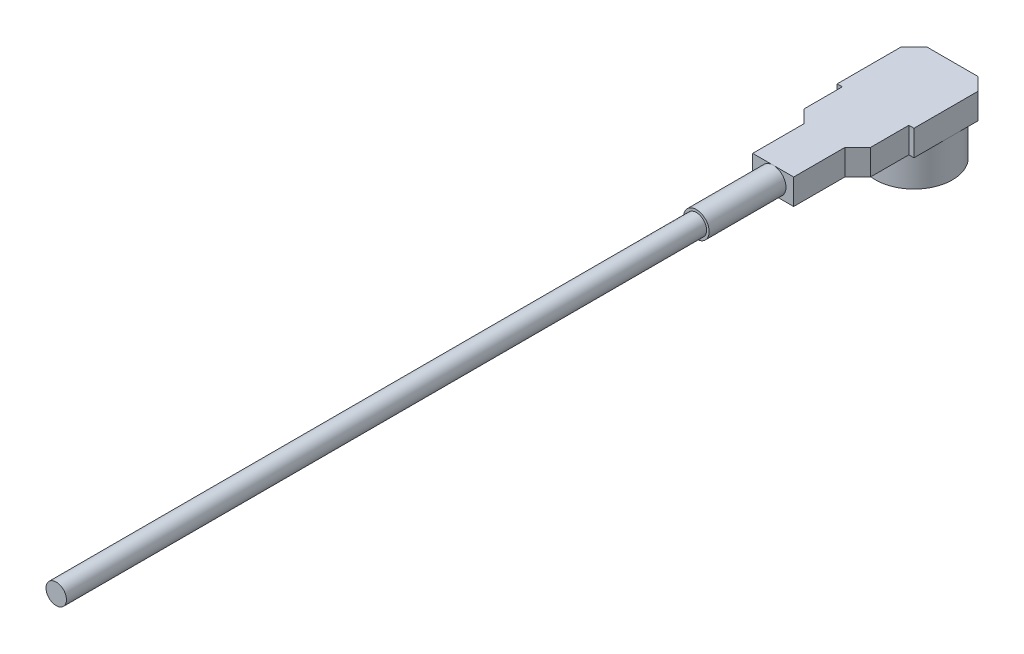
ISO-10303-21;
HEADER;
FILE_DESCRIPTION(('STEP AP214'),'2;1');
FILE_NAME('part.step','',(''),(''),'','','');
FILE_SCHEMA(('AUTOMOTIVE_DESIGN { 1 0 10303 214 1 1 1 1 }'));
ENDSEC;
DATA;
#1=APPLICATION_CONTEXT('core data for automotive mechanical design processes');
#2=APPLICATION_PROTOCOL_DEFINITION('international standard','automotive_design',2000,#1);
#3=PRODUCT_CONTEXT('',#1,'mechanical');
#4=PRODUCT('Part','Part','',(#3));
#5=PRODUCT_RELATED_PRODUCT_CATEGORY('part','',(#4));
#6=PRODUCT_DEFINITION_FORMATION('','',#4);
#7=PRODUCT_DEFINITION_CONTEXT('part definition',#1,'design');
#8=PRODUCT_DEFINITION('design','',#6,#7);
#9=PRODUCT_DEFINITION_SHAPE('','',#8);
#10=(LENGTH_UNIT() NAMED_UNIT(*) SI_UNIT(.MILLI.,.METRE.));
#11=(NAMED_UNIT(*) PLANE_ANGLE_UNIT() SI_UNIT($,.RADIAN.));
#12=(NAMED_UNIT(*) SI_UNIT($,.STERADIAN.) SOLID_ANGLE_UNIT());
#13=UNCERTAINTY_MEASURE_WITH_UNIT(LENGTH_MEASURE(1.E-05),#10,'distance_accuracy_value','');
#14=(GEOMETRIC_REPRESENTATION_CONTEXT(3) GLOBAL_UNCERTAINTY_ASSIGNED_CONTEXT((#13)) GLOBAL_UNIT_ASSIGNED_CONTEXT((#10,
#11,#12)) REPRESENTATION_CONTEXT('',''));
#15=CARTESIAN_POINT('',(0.,0.,0.));
#16=DIRECTION('',(0.,0.,1.));
#17=DIRECTION('',(1.,0.,0.));
#18=AXIS2_PLACEMENT_3D('',#15,#16,#17);
#19=CARTESIAN_POINT('',(0.,1.5,5.5));
#20=DIRECTION('',(0.,0.,1.));
#21=DIRECTION('',(1.,0.,0.));
#22=AXIS2_PLACEMENT_3D('',#19,#20,#21);
#23=PLANE('',#22);
#24=CARTESIAN_POINT('',(0.,2.,5.5));
#25=DIRECTION('',(0.,0.,1.));
#26=DIRECTION('',(1.,0.,0.));
#27=AXIS2_PLACEMENT_3D('',#24,#25,#26);
#28=CIRCLE('',#27,0.5);
#29=CARTESIAN_POINT('',(0.,2.5,5.5));
#30=VERTEX_POINT('',#29);
#31=CARTESIAN_POINT('',(0.,1.5,5.5));
#32=VERTEX_POINT('',#31);
#33=EDGE_CURVE('E181',#30,#32,#28,.T.);
#34=ORIENTED_EDGE('',*,*,#33,.F.);
#35=DIRECTION('',(1.,0.,0.));
#36=VECTOR('',#35,1.);
#37=CARTESIAN_POINT('',(0.,2.5,5.5));
#38=LINE('',#37,#36);
#39=CARTESIAN_POINT('',(-0.8,2.5,5.5));
#40=VERTEX_POINT('',#39);
#41=EDGE_CURVE('E160',#40,#30,#38,.T.);
#42=ORIENTED_EDGE('',*,*,#41,.F.);
#43=DIRECTION('',(0.,1.,0.));
#44=VECTOR('',#43,1.);
#45=CARTESIAN_POINT('',(-0.8,1.5,5.5));
#46=LINE('',#45,#44);
#47=CARTESIAN_POINT('',(-0.8,1.5,5.5));
#48=VERTEX_POINT('',#47);
#49=EDGE_CURVE('E339',#48,#40,#46,.T.);
#50=ORIENTED_EDGE('',*,*,#49,.F.);
#51=DIRECTION('',(1.,0.,0.));
#52=VECTOR('',#51,1.);
#53=CARTESIAN_POINT('',(0.,1.5,5.5));
#54=LINE('',#53,#52);
#55=EDGE_CURVE('E183',#48,#32,#54,.T.);
#56=ORIENTED_EDGE('',*,*,#55,.T.);
#57=EDGE_LOOP('',(#34,#42,#50,#56));
#58=FACE_BOUND('',#57,.T.);
#59=ADVANCED_FACE('F41',(#58),#23,.T.);
#60=CARTESIAN_POINT('',(0.,2.5,0.));
#61=DIRECTION('',(0.,-1.,0.));
#62=DIRECTION('',(0.,0.,-1.));
#63=AXIS2_PLACEMENT_3D('',#60,#61,#62);
#64=CYLINDRICAL_SURFACE('',#63,1.5);
#65=CARTESIAN_POINT('',(0.,0.,0.));
#66=DIRECTION('',(0.,1.,0.));
#67=DIRECTION('',(0.,0.,1.));
#68=AXIS2_PLACEMENT_3D('',#65,#66,#67);
#69=CIRCLE('',#68,1.5);
#70=CARTESIAN_POINT('',(0.,0.,1.5));
#71=VERTEX_POINT('',#70);
#72=EDGE_CURVE('E45',#71,#71,#69,.T.);
#73=ORIENTED_EDGE('',*,*,#72,.T.);
#74=EDGE_LOOP('',(#73));
#75=FACE_BOUND('',#74,.T.);
#76=CARTESIAN_POINT('',(0.,1.5,0.));
#77=DIRECTION('',(0.,1.,0.));
#78=DIRECTION('',(0.,0.,1.));
#79=AXIS2_PLACEMENT_3D('',#76,#77,#78);
#80=CIRCLE('',#79,1.5);
#81=CARTESIAN_POINT('',(1.5,1.5,0.));
#82=VERTEX_POINT('',#81);
#83=CARTESIAN_POINT('',(0.,1.5,-1.5));
#84=VERTEX_POINT('',#83);
#85=EDGE_CURVE('E346',#82,#84,#80,.T.);
#86=ORIENTED_EDGE('',*,*,#85,.F.);
#87=CARTESIAN_POINT('',(-1.5,1.5,0.));
#88=VERTEX_POINT('',#87);
#89=EDGE_CURVE('E301',#88,#82,#80,.T.);
#90=ORIENTED_EDGE('',*,*,#89,.F.);
#91=EDGE_CURVE('E66',#84,#88,#80,.T.);
#92=ORIENTED_EDGE('',*,*,#91,.F.);
#93=EDGE_LOOP('',(#86,#90,#92));
#94=FACE_BOUND('',#93,.T.);
#95=ADVANCED_FACE('F43',(#75,#94),#64,.T.);
#96=CARTESIAN_POINT('',(0.,2.5,0.));
#97=DIRECTION('',(0.,1.,0.));
#98=DIRECTION('',(0.,0.,1.));
#99=AXIS2_PLACEMENT_3D('',#96,#97,#98);
#100=PLANE('',#99);
#101=DIRECTION('',(-1.,0.,0.));
#102=VECTOR('',#101,1.);
#103=CARTESIAN_POINT('',(0.,2.5,1.5));
#104=LINE('',#103,#102);
#105=CARTESIAN_POINT('',(1.5,2.5,1.5));
#106=VERTEX_POINT('',#105);
#107=CARTESIAN_POINT('',(1.3,2.5,1.5));
#108=VERTEX_POINT('',#107);
#109=EDGE_CURVE('E271',#106,#108,#104,.T.);
#110=ORIENTED_EDGE('',*,*,#109,.F.);
#111=DIRECTION('',(0.,0.,-1.));
#112=VECTOR('',#111,1.);
#113=CARTESIAN_POINT('',(1.5,2.5,0.));
#114=LINE('',#113,#112);
#115=CARTESIAN_POINT('',(1.5,2.5,-1.00000000000001));
#116=VERTEX_POINT('',#115);
#117=EDGE_CURVE('E275',#106,#116,#114,.T.);
#118=ORIENTED_EDGE('',*,*,#117,.T.);
#119=DIRECTION('',(0.707106781186556,0.,0.707106781186539));
#120=VECTOR('',#119,1.);
#121=CARTESIAN_POINT('',(1.24999999999999,2.5,-1.25000000000002));
#122=LINE('',#121,#120);
#123=CARTESIAN_POINT('',(1.,2.5,-1.5));
#124=VERTEX_POINT('',#123);
#125=EDGE_CURVE('E278',#124,#116,#122,.T.);
#126=ORIENTED_EDGE('',*,*,#125,.F.);
#127=DIRECTION('',(-1.,0.,0.));
#128=VECTOR('',#127,1.);
#129=CARTESIAN_POINT('',(0.,2.5,-1.5));
#130=LINE('',#129,#128);
#131=CARTESIAN_POINT('',(-1.,2.5,-1.5));
#132=VERTEX_POINT('',#131);
#133=EDGE_CURVE('E282',#124,#132,#130,.T.);
#134=ORIENTED_EDGE('',*,*,#133,.T.);
#135=DIRECTION('',(-0.707106781186542,0.,0.707106781186554));
#136=VECTOR('',#135,1.);
#137=CARTESIAN_POINT('',(-1.25000000000001,2.5,-1.24999999999999));
#138=LINE('',#137,#136);
#139=CARTESIAN_POINT('',(-1.5,2.5,-0.999999999999991));
#140=VERTEX_POINT('',#139);
#141=EDGE_CURVE('E285',#132,#140,#138,.T.);
#142=ORIENTED_EDGE('',*,*,#141,.T.);
#143=DIRECTION('',(0.,0.,-1.));
#144=VECTOR('',#143,1.);
#145=CARTESIAN_POINT('',(-1.5,2.5,0.));
#146=LINE('',#145,#144);
#147=CARTESIAN_POINT('',(-1.5,2.5,1.5));
#148=VERTEX_POINT('',#147);
#149=EDGE_CURVE('E289',#148,#140,#146,.T.);
#150=ORIENTED_EDGE('',*,*,#149,.F.);
#151=DIRECTION('',(-1.,0.,0.));
#152=VECTOR('',#151,1.);
#153=CARTESIAN_POINT('',(0.,2.5,1.5));
#154=LINE('',#153,#152);
#155=CARTESIAN_POINT('',(-1.3,2.5,1.5));
#156=VERTEX_POINT('',#155);
#157=EDGE_CURVE('E292',#156,#148,#154,.T.);
#158=ORIENTED_EDGE('',*,*,#157,.F.);
#159=DIRECTION('',(0.,0.,1.));
#160=VECTOR('',#159,1.);
#161=CARTESIAN_POINT('',(-1.3,2.5,0.));
#162=LINE('',#161,#160);
#163=CARTESIAN_POINT('',(-1.3,2.5,3.));
#164=VERTEX_POINT('',#163);
#165=EDGE_CURVE('E202',#156,#164,#162,.T.);
#166=ORIENTED_EDGE('',*,*,#165,.T.);
#167=DIRECTION('',(-0.707106781186548,0.,-0.707106781186547));
#168=VECTOR('',#167,1.);
#169=CARTESIAN_POINT('',(-2.15,2.5,2.15));
#170=LINE('',#169,#168);
#171=CARTESIAN_POINT('',(-0.8,2.5,3.5));
#172=VERTEX_POINT('',#171);
#173=EDGE_CURVE('E255',#172,#164,#170,.T.);
#174=ORIENTED_EDGE('',*,*,#173,.F.);
#175=DIRECTION('',(0.,0.,1.));
#176=VECTOR('',#175,1.);
#177=CARTESIAN_POINT('',(-0.8,2.5,0.));
#178=LINE('',#177,#176);
#179=EDGE_CURVE('E168',#172,#40,#178,.T.);
#180=ORIENTED_EDGE('',*,*,#179,.T.);
#181=ORIENTED_EDGE('',*,*,#41,.T.);
#182=CARTESIAN_POINT('',(0.799999999999999,2.5,5.5));
#183=VERTEX_POINT('',#182);
#184=EDGE_CURVE('E164',#30,#183,#38,.T.);
#185=ORIENTED_EDGE('',*,*,#184,.T.);
#186=DIRECTION('',(0.,0.,-1.));
#187=VECTOR('',#186,1.);
#188=CARTESIAN_POINT('',(0.799999999999999,2.5,0.));
#189=LINE('',#188,#187);
#190=CARTESIAN_POINT('',(0.799999999999999,2.5,3.5));
#191=VERTEX_POINT('',#190);
#192=EDGE_CURVE('E172',#183,#191,#189,.T.);
#193=ORIENTED_EDGE('',*,*,#192,.T.);
#194=DIRECTION('',(0.707106781186548,0.,-0.707106781186547));
#195=VECTOR('',#194,1.);
#196=CARTESIAN_POINT('',(2.15,2.5,2.15));
#197=LINE('',#196,#195);
#198=CARTESIAN_POINT('',(1.3,2.5,3.));
#199=VERTEX_POINT('',#198);
#200=EDGE_CURVE('E263',#191,#199,#197,.T.);
#201=ORIENTED_EDGE('',*,*,#200,.T.);
#202=DIRECTION('',(0.,0.,-1.));
#203=VECTOR('',#202,1.);
#204=CARTESIAN_POINT('',(1.3,2.5,0.));
#205=LINE('',#204,#203);
#206=EDGE_CURVE('E267',#199,#108,#205,.T.);
#207=ORIENTED_EDGE('',*,*,#206,.T.);
#208=EDGE_LOOP('',(#110,#118,#126,#134,#142,#150,#158,#166,#174,#180,#181,#185,#193,#201,#207));
#209=FACE_BOUND('',#208,.T.);
#210=ADVANCED_FACE('F162',(#209),#100,.T.);
#211=CARTESIAN_POINT('',(0.,0.,0.));
#212=DIRECTION('',(0.,1.,0.));
#213=DIRECTION('',(0.,0.,1.));
#214=AXIS2_PLACEMENT_3D('',#211,#212,#213);
#215=PLANE('',#214);
#216=ORIENTED_EDGE('',*,*,#72,.F.);
#217=EDGE_LOOP('',(#216));
#218=FACE_BOUND('',#217,.T.);
#219=CARTESIAN_POINT('',(0.,0.,0.));
#220=DIRECTION('',(0.,1.,0.));
#221=DIRECTION('',(0.,0.,1.));
#222=AXIS2_PLACEMENT_3D('',#219,#220,#221);
#223=CIRCLE('',#222,1.);
#224=CARTESIAN_POINT('',(0.,0.,1.));
#225=VERTEX_POINT('',#224);
#226=EDGE_CURVE('E193',#225,#225,#223,.T.);
#227=ORIENTED_EDGE('',*,*,#226,.T.);
#228=EDGE_LOOP('',(#227));
#229=FACE_BOUND('',#228,.T.);
#230=ADVANCED_FACE('F506',(#218,#229),#215,.F.);
#231=CARTESIAN_POINT('',(0.,2.5,0.));
#232=DIRECTION('',(0.,-1.,0.));
#233=DIRECTION('',(0.,0.,-1.));
#234=AXIS2_PLACEMENT_3D('',#231,#232,#233);
#235=CYLINDRICAL_SURFACE('',#234,1.);
#236=CARTESIAN_POINT('',(0.,1.5,0.));
#237=DIRECTION('',(0.,-1.,0.));
#238=DIRECTION('',(0.,0.,-1.));
#239=AXIS2_PLACEMENT_3D('',#236,#237,#238);
#240=CIRCLE('',#239,1.);
#241=CARTESIAN_POINT('',(0.,1.5,-1.));
#242=VERTEX_POINT('',#241);
#243=EDGE_CURVE('E11',#242,#242,#240,.T.);
#244=ORIENTED_EDGE('',*,*,#243,.F.);
#245=EDGE_LOOP('',(#244));
#246=FACE_BOUND('',#245,.T.);
#247=ORIENTED_EDGE('',*,*,#226,.F.);
#248=EDGE_LOOP('',(#247));
#249=FACE_BOUND('',#248,.T.);
#250=ADVANCED_FACE('F459',(#246,#249),#235,.F.);
#251=CARTESIAN_POINT('',(-1.5,1.5,0.));
#252=DIRECTION('',(1.,0.,0.));
#253=DIRECTION('',(0.,0.,-1.));
#254=AXIS2_PLACEMENT_3D('',#251,#252,#253);
#255=PLANE('',#254);
#256=ORIENTED_EDGE('',*,*,#149,.T.);
#257=DIRECTION('',(0.,1.,0.));
#258=VECTOR('',#257,1.);
#259=CARTESIAN_POINT('',(-1.5,1.5,-0.999999999999991));
#260=LINE('',#259,#258);
#261=CARTESIAN_POINT('',(-1.5,1.5,-0.999999999999991));
#262=VERTEX_POINT('',#261);
#263=EDGE_CURVE('E309',#262,#140,#260,.T.);
#264=ORIENTED_EDGE('',*,*,#263,.F.);
#265=DIRECTION('',(0.,0.,-1.));
#266=VECTOR('',#265,1.);
#267=CARTESIAN_POINT('',(-1.5,1.5,0.));
#268=LINE('',#267,#266);
#269=EDGE_CURVE('E242',#88,#262,#268,.T.);
#270=ORIENTED_EDGE('',*,*,#269,.F.);
#271=CARTESIAN_POINT('',(-1.5,1.5,1.5));
#272=VERTEX_POINT('',#271);
#273=EDGE_CURVE('E243',#272,#88,#268,.T.);
#274=ORIENTED_EDGE('',*,*,#273,.F.);
#275=DIRECTION('',(0.,1.,0.));
#276=VECTOR('',#275,1.);
#277=CARTESIAN_POINT('',(-1.5,1.5,1.5));
#278=LINE('',#277,#276);
#279=EDGE_CURVE('E305',#272,#148,#278,.T.);
#280=ORIENTED_EDGE('',*,*,#279,.T.);
#281=EDGE_LOOP('',(#256,#264,#270,#274,#280));
#282=FACE_BOUND('',#281,.T.);
#283=ADVANCED_FACE('F364',(#282),#255,.F.);
#284=CARTESIAN_POINT('',(0.,1.5,-1.5));
#285=DIRECTION('',(0.,0.,-1.));
#286=DIRECTION('',(-1.,0.,0.));
#287=AXIS2_PLACEMENT_3D('',#284,#285,#286);
#288=PLANE('',#287);
#289=DIRECTION('',(-1.,0.,0.));
#290=VECTOR('',#289,1.);
#291=CARTESIAN_POINT('',(0.,1.5,-1.5));
#292=LINE('',#291,#290);
#293=CARTESIAN_POINT('',(1.,1.5,-1.5));
#294=VERTEX_POINT('',#293);
#295=EDGE_CURVE('E234',#294,#84,#292,.T.);
#296=ORIENTED_EDGE('',*,*,#295,.T.);
#297=CARTESIAN_POINT('',(-1.,1.5,-1.5));
#298=VERTEX_POINT('',#297);
#299=EDGE_CURVE('E233',#84,#298,#292,.T.);
#300=ORIENTED_EDGE('',*,*,#299,.T.);
#301=DIRECTION('',(0.,1.,0.));
#302=VECTOR('',#301,1.);
#303=CARTESIAN_POINT('',(-1.,1.5,-1.5));
#304=LINE('',#303,#302);
#305=EDGE_CURVE('E313',#298,#132,#304,.T.);
#306=ORIENTED_EDGE('',*,*,#305,.T.);
#307=ORIENTED_EDGE('',*,*,#133,.F.);
#308=DIRECTION('',(0.,1.,0.));
#309=VECTOR('',#308,1.);
#310=CARTESIAN_POINT('',(1.,1.5,-1.5));
#311=LINE('',#310,#309);
#312=EDGE_CURVE('E317',#294,#124,#311,.T.);
#313=ORIENTED_EDGE('',*,*,#312,.F.);
#314=EDGE_LOOP('',(#296,#300,#306,#307,#313));
#315=FACE_BOUND('',#314,.T.);
#316=ADVANCED_FACE('F384',(#315),#288,.T.);
#317=CARTESIAN_POINT('',(1.5,1.5,0.));
#318=DIRECTION('',(1.,0.,0.));
#319=DIRECTION('',(0.,0.,-1.));
#320=AXIS2_PLACEMENT_3D('',#317,#318,#319);
#321=PLANE('',#320);
#322=DIRECTION('',(0.,0.,-1.));
#323=VECTOR('',#322,1.);
#324=CARTESIAN_POINT('',(1.5,1.5,0.));
#325=LINE('',#324,#323);
#326=CARTESIAN_POINT('',(1.5,1.5,1.5));
#327=VERTEX_POINT('',#326);
#328=EDGE_CURVE('E225',#327,#82,#325,.T.);
#329=ORIENTED_EDGE('',*,*,#328,.T.);
#330=CARTESIAN_POINT('',(1.5,1.5,-1.00000000000001));
#331=VERTEX_POINT('',#330);
#332=EDGE_CURVE('E224',#82,#331,#325,.T.);
#333=ORIENTED_EDGE('',*,*,#332,.T.);
#334=DIRECTION('',(0.,1.,0.));
#335=VECTOR('',#334,1.);
#336=CARTESIAN_POINT('',(1.5,1.5,-1.00000000000001));
#337=LINE('',#336,#335);
#338=EDGE_CURVE('E320',#331,#116,#337,.T.);
#339=ORIENTED_EDGE('',*,*,#338,.T.);
#340=ORIENTED_EDGE('',*,*,#117,.F.);
#341=DIRECTION('',(0.,1.,0.));
#342=VECTOR('',#341,1.);
#343=CARTESIAN_POINT('',(1.5,1.5,1.5));
#344=LINE('',#343,#342);
#345=EDGE_CURVE('E324',#327,#106,#344,.T.);
#346=ORIENTED_EDGE('',*,*,#345,.F.);
#347=EDGE_LOOP('',(#329,#333,#339,#340,#346));
#348=FACE_BOUND('',#347,.T.);
#349=ADVANCED_FACE('F445',(#348),#321,.T.);
#350=CARTESIAN_POINT('',(0.,1.5,0.));
#351=DIRECTION('',(0.,1.,0.));
#352=DIRECTION('',(0.,0.,1.));
#353=AXIS2_PLACEMENT_3D('',#350,#351,#352);
#354=PLANE('',#353);
#355=ORIENTED_EDGE('',*,*,#332,.F.);
#356=ORIENTED_EDGE('',*,*,#85,.T.);
#357=ORIENTED_EDGE('',*,*,#295,.F.);
#358=DIRECTION('',(0.707106781186556,0.,0.707106781186539));
#359=VECTOR('',#358,1.);
#360=CARTESIAN_POINT('',(1.24999999999999,1.5,-1.25000000000002));
#361=LINE('',#360,#359);
#362=EDGE_CURVE('E229',#294,#331,#361,.T.);
#363=ORIENTED_EDGE('',*,*,#362,.T.);
#364=EDGE_LOOP('',(#355,#356,#357,#363));
#365=FACE_BOUND('',#364,.T.);
#366=ADVANCED_FACE('F448',(#365),#354,.F.);
#367=ORIENTED_EDGE('',*,*,#299,.F.);
#368=ORIENTED_EDGE('',*,*,#91,.T.);
#369=ORIENTED_EDGE('',*,*,#269,.T.);
#370=DIRECTION('',(-0.707106781186542,0.,0.707106781186554));
#371=VECTOR('',#370,1.);
#372=CARTESIAN_POINT('',(-1.25000000000001,1.5,-1.24999999999999));
#373=LINE('',#372,#371);
#374=EDGE_CURVE('E238',#298,#262,#373,.T.);
#375=ORIENTED_EDGE('',*,*,#374,.F.);
#376=EDGE_LOOP('',(#367,#368,#369,#375));
#377=FACE_BOUND('',#376,.T.);
#378=ADVANCED_FACE('F359',(#377),#354,.F.);
#379=ORIENTED_EDGE('',*,*,#273,.T.);
#380=ORIENTED_EDGE('',*,*,#89,.T.);
#381=ORIENTED_EDGE('',*,*,#328,.F.);
#382=DIRECTION('',(-1.,0.,0.));
#383=VECTOR('',#382,1.);
#384=CARTESIAN_POINT('',(0.,1.5,1.5));
#385=LINE('',#384,#383);
#386=CARTESIAN_POINT('',(1.3,1.5,1.5));
#387=VERTEX_POINT('',#386);
#388=EDGE_CURVE('E221',#327,#387,#385,.T.);
#389=ORIENTED_EDGE('',*,*,#388,.T.);
#390=DIRECTION('',(0.,0.,-1.));
#391=VECTOR('',#390,1.);
#392=CARTESIAN_POINT('',(1.3,1.5,0.));
#393=LINE('',#392,#391);
#394=CARTESIAN_POINT('',(1.3,1.5,3.));
#395=VERTEX_POINT('',#394);
#396=EDGE_CURVE('E217',#395,#387,#393,.T.);
#397=ORIENTED_EDGE('',*,*,#396,.F.);
#398=DIRECTION('',(0.707106781186548,0.,-0.707106781186547));
#399=VECTOR('',#398,1.);
#400=CARTESIAN_POINT('',(2.15,1.5,2.15));
#401=LINE('',#400,#399);
#402=CARTESIAN_POINT('',(0.799999999999999,1.5,3.5));
#403=VERTEX_POINT('',#402);
#404=EDGE_CURVE('E213',#403,#395,#401,.T.);
#405=ORIENTED_EDGE('',*,*,#404,.F.);
#406=DIRECTION('',(0.,0.,-1.));
#407=VECTOR('',#406,1.);
#408=CARTESIAN_POINT('',(0.799999999999999,1.5,0.));
#409=LINE('',#408,#407);
#410=CARTESIAN_POINT('',(0.799999999999999,1.5,5.5));
#411=VERTEX_POINT('',#410);
#412=EDGE_CURVE('E209',#411,#403,#409,.T.);
#413=ORIENTED_EDGE('',*,*,#412,.F.);
#414=EDGE_CURVE('E206',#32,#411,#54,.T.);
#415=ORIENTED_EDGE('',*,*,#414,.F.);
#416=ORIENTED_EDGE('',*,*,#55,.F.);
#417=DIRECTION('',(0.,0.,1.));
#418=VECTOR('',#417,1.);
#419=CARTESIAN_POINT('',(-0.8,1.5,0.));
#420=LINE('',#419,#418);
#421=CARTESIAN_POINT('',(-0.8,1.5,3.5));
#422=VERTEX_POINT('',#421);
#423=EDGE_CURVE('E201',#422,#48,#420,.T.);
#424=ORIENTED_EDGE('',*,*,#423,.F.);
#425=DIRECTION('',(-0.707106781186548,0.,-0.707106781186547));
#426=VECTOR('',#425,1.);
#427=CARTESIAN_POINT('',(-2.15,1.5,2.15));
#428=LINE('',#427,#426);
#429=CARTESIAN_POINT('',(-1.3,1.5,3.));
#430=VERTEX_POINT('',#429);
#431=EDGE_CURVE('E198',#422,#430,#428,.T.);
#432=ORIENTED_EDGE('',*,*,#431,.T.);
#433=DIRECTION('',(0.,0.,1.));
#434=VECTOR('',#433,1.);
#435=CARTESIAN_POINT('',(-1.3,1.5,0.));
#436=LINE('',#435,#434);
#437=CARTESIAN_POINT('',(-1.3,1.5,1.5));
#438=VERTEX_POINT('',#437);
#439=EDGE_CURVE('E250',#438,#430,#436,.T.);
#440=ORIENTED_EDGE('',*,*,#439,.F.);
#441=DIRECTION('',(-1.,0.,0.));
#442=VECTOR('',#441,1.);
#443=CARTESIAN_POINT('',(0.,1.5,1.5));
#444=LINE('',#443,#442);
#445=EDGE_CURVE('E247',#438,#272,#444,.T.);
#446=ORIENTED_EDGE('',*,*,#445,.T.);
#447=EDGE_LOOP('',(#379,#380,#381,#389,#397,#405,#413,#415,#416,#424,#432,#440,#446));
#448=FACE_BOUND('',#447,.T.);
#449=ADVANCED_FACE('F367',(#448),#354,.F.);
#450=CARTESIAN_POINT('',(-2.15,1.5,2.15));
#451=DIRECTION('',(0.707106781186547,0.,-0.707106781186548));
#452=DIRECTION('',(-0.707106781186548,0.,-0.707106781186547));
#453=AXIS2_PLACEMENT_3D('',#450,#451,#452);
#454=PLANE('',#453);
#455=ORIENTED_EDGE('',*,*,#173,.T.);
#456=DIRECTION('',(0.,1.,0.));
#457=VECTOR('',#456,1.);
#458=CARTESIAN_POINT('',(-1.3,1.5,3.));
#459=LINE('',#458,#457);
#460=EDGE_CURVE('E298',#430,#164,#459,.T.);
#461=ORIENTED_EDGE('',*,*,#460,.F.);
#462=ORIENTED_EDGE('',*,*,#431,.F.);
#463=DIRECTION('',(0.,1.,0.));
#464=VECTOR('',#463,1.);
#465=CARTESIAN_POINT('',(-0.8,1.5,3.5));
#466=LINE('',#465,#464);
#467=EDGE_CURVE('E254',#422,#172,#466,.T.);
#468=ORIENTED_EDGE('',*,*,#467,.T.);
#469=EDGE_LOOP('',(#455,#461,#462,#468));
#470=FACE_BOUND('',#469,.T.);
#471=ADVANCED_FACE('F465',(#470),#454,.F.);
#472=CARTESIAN_POINT('',(-1.3,1.5,0.));
#473=DIRECTION('',(-1.,0.,0.));
#474=DIRECTION('',(0.,0.,1.));
#475=AXIS2_PLACEMENT_3D('',#472,#473,#474);
#476=PLANE('',#475);
#477=ORIENTED_EDGE('',*,*,#165,.F.);
#478=DIRECTION('',(0.,1.,0.));
#479=VECTOR('',#478,1.);
#480=CARTESIAN_POINT('',(-1.3,1.5,1.5));
#481=LINE('',#480,#479);
#482=EDGE_CURVE('E302',#438,#156,#481,.T.);
#483=ORIENTED_EDGE('',*,*,#482,.F.);
#484=ORIENTED_EDGE('',*,*,#439,.T.);
#485=ORIENTED_EDGE('',*,*,#460,.T.);
#486=EDGE_LOOP('',(#477,#483,#484,#485));
#487=FACE_BOUND('',#486,.T.);
#488=ADVANCED_FACE('F462',(#487),#476,.T.);
#489=CARTESIAN_POINT('',(0.,1.5,1.5));
#490=DIRECTION('',(0.,0.,-1.));
#491=DIRECTION('',(-1.,0.,0.));
#492=AXIS2_PLACEMENT_3D('',#489,#490,#491);
#493=PLANE('',#492);
#494=ORIENTED_EDGE('',*,*,#157,.T.);
#495=ORIENTED_EDGE('',*,*,#279,.F.);
#496=ORIENTED_EDGE('',*,*,#445,.F.);
#497=ORIENTED_EDGE('',*,*,#482,.T.);
#498=EDGE_LOOP('',(#494,#495,#496,#497));
#499=FACE_BOUND('',#498,.T.);
#500=ADVANCED_FACE('F373',(#499),#493,.F.);
#501=CARTESIAN_POINT('',(-1.25000000000001,1.5,-1.24999999999999));
#502=DIRECTION('',(-0.707106781186554,0.,-0.707106781186542));
#503=DIRECTION('',(-0.707106781186542,0.,0.707106781186554));
#504=AXIS2_PLACEMENT_3D('',#501,#502,#503);
#505=PLANE('',#504);
#506=ORIENTED_EDGE('',*,*,#141,.F.);
#507=ORIENTED_EDGE('',*,*,#305,.F.);
#508=ORIENTED_EDGE('',*,*,#374,.T.);
#509=ORIENTED_EDGE('',*,*,#263,.T.);
#510=EDGE_LOOP('',(#506,#507,#508,#509));
#511=FACE_BOUND('',#510,.T.);
#512=ADVANCED_FACE('F382',(#511),#505,.T.);
#513=CARTESIAN_POINT('',(1.24999999999999,1.5,-1.25000000000002));
#514=DIRECTION('',(-0.707106781186539,0.,0.707106781186556));
#515=DIRECTION('',(0.707106781186556,0.,0.707106781186539));
#516=AXIS2_PLACEMENT_3D('',#513,#514,#515);
#517=PLANE('',#516);
#518=ORIENTED_EDGE('',*,*,#125,.T.);
#519=ORIENTED_EDGE('',*,*,#338,.F.);
#520=ORIENTED_EDGE('',*,*,#362,.F.);
#521=ORIENTED_EDGE('',*,*,#312,.T.);
#522=EDGE_LOOP('',(#518,#519,#520,#521));
#523=FACE_BOUND('',#522,.T.);
#524=ADVANCED_FACE('F443',(#523),#517,.F.);
#525=CARTESIAN_POINT('',(0.,1.5,1.5));
#526=DIRECTION('',(0.,0.,-1.));
#527=DIRECTION('',(-1.,0.,0.));
#528=AXIS2_PLACEMENT_3D('',#525,#526,#527);
#529=PLANE('',#528);
#530=ORIENTED_EDGE('',*,*,#109,.T.);
#531=DIRECTION('',(0.,1.,0.));
#532=VECTOR('',#531,1.);
#533=CARTESIAN_POINT('',(1.3,1.5,1.5));
#534=LINE('',#533,#532);
#535=EDGE_CURVE('E328',#387,#108,#534,.T.);
#536=ORIENTED_EDGE('',*,*,#535,.F.);
#537=ORIENTED_EDGE('',*,*,#388,.F.);
#538=ORIENTED_EDGE('',*,*,#345,.T.);
#539=EDGE_LOOP('',(#530,#536,#537,#538));
#540=FACE_BOUND('',#539,.T.);
#541=ADVANCED_FACE('F439',(#540),#529,.F.);
#542=CARTESIAN_POINT('',(1.3,1.5,0.));
#543=DIRECTION('',(1.,0.,0.));
#544=DIRECTION('',(0.,0.,-1.));
#545=AXIS2_PLACEMENT_3D('',#542,#543,#544);
#546=PLANE('',#545);
#547=ORIENTED_EDGE('',*,*,#206,.F.);
#548=DIRECTION('',(0.,1.,0.));
#549=VECTOR('',#548,1.);
#550=CARTESIAN_POINT('',(1.3,1.5,3.));
#551=LINE('',#550,#549);
#552=EDGE_CURVE('E331',#395,#199,#551,.T.);
#553=ORIENTED_EDGE('',*,*,#552,.F.);
#554=ORIENTED_EDGE('',*,*,#396,.T.);
#555=ORIENTED_EDGE('',*,*,#535,.T.);
#556=EDGE_LOOP('',(#547,#553,#554,#555));
#557=FACE_BOUND('',#556,.T.);
#558=ADVANCED_FACE('F433',(#557),#546,.T.);
#559=CARTESIAN_POINT('',(2.15,1.5,2.15));
#560=DIRECTION('',(0.707106781186547,0.,0.707106781186548));
#561=DIRECTION('',(0.707106781186548,0.,-0.707106781186547));
#562=AXIS2_PLACEMENT_3D('',#559,#560,#561);
#563=PLANE('',#562);
#564=ORIENTED_EDGE('',*,*,#200,.F.);
#565=DIRECTION('',(0.,1.,0.));
#566=VECTOR('',#565,1.);
#567=CARTESIAN_POINT('',(0.799999999999999,1.5,3.5));
#568=LINE('',#567,#566);
#569=EDGE_CURVE('E334',#403,#191,#568,.T.);
#570=ORIENTED_EDGE('',*,*,#569,.F.);
#571=ORIENTED_EDGE('',*,*,#404,.T.);
#572=ORIENTED_EDGE('',*,*,#552,.T.);
#573=EDGE_LOOP('',(#564,#570,#571,#572));
#574=FACE_BOUND('',#573,.T.);
#575=ADVANCED_FACE('F428',(#574),#563,.T.);
#576=CARTESIAN_POINT('',(0.799999999999999,1.5,0.));
#577=DIRECTION('',(1.,0.,0.));
#578=DIRECTION('',(0.,0.,-1.));
#579=AXIS2_PLACEMENT_3D('',#576,#577,#578);
#580=PLANE('',#579);
#581=ORIENTED_EDGE('',*,*,#192,.F.);
#582=DIRECTION('',(0.,1.,0.));
#583=VECTOR('',#582,1.);
#584=CARTESIAN_POINT('',(0.799999999999999,1.5,5.5));
#585=LINE('',#584,#583);
#586=EDGE_CURVE('E176',#411,#183,#585,.T.);
#587=ORIENTED_EDGE('',*,*,#586,.F.);
#588=ORIENTED_EDGE('',*,*,#412,.T.);
#589=ORIENTED_EDGE('',*,*,#569,.T.);
#590=EDGE_LOOP('',(#581,#587,#588,#589));
#591=FACE_BOUND('',#590,.T.);
#592=ADVANCED_FACE('F422',(#591),#580,.T.);
#593=EDGE_CURVE('E51',#32,#30,#28,.T.);
#594=ORIENTED_EDGE('',*,*,#593,.F.);
#595=ORIENTED_EDGE('',*,*,#414,.T.);
#596=ORIENTED_EDGE('',*,*,#586,.T.);
#597=ORIENTED_EDGE('',*,*,#184,.F.);
#598=EDGE_LOOP('',(#594,#595,#596,#597));
#599=FACE_BOUND('',#598,.T.);
#600=ADVANCED_FACE('F174',(#599),#23,.T.);
#601=CARTESIAN_POINT('',(-0.8,1.5,0.));
#602=DIRECTION('',(-1.,0.,0.));
#603=DIRECTION('',(0.,0.,1.));
#604=AXIS2_PLACEMENT_3D('',#601,#602,#603);
#605=PLANE('',#604);
#606=ORIENTED_EDGE('',*,*,#179,.F.);
#607=ORIENTED_EDGE('',*,*,#467,.F.);
#608=ORIENTED_EDGE('',*,*,#423,.T.);
#609=ORIENTED_EDGE('',*,*,#49,.T.);
#610=EDGE_LOOP('',(#606,#607,#608,#609));
#611=FACE_BOUND('',#610,.T.);
#612=ADVANCED_FACE('F421',(#611),#605,.T.);
#613=CARTESIAN_POINT('',(0.,2.,8.5));
#614=DIRECTION('',(0.,0.,-1.));
#615=DIRECTION('',(-1.,0.,0.));
#616=AXIS2_PLACEMENT_3D('',#613,#614,#615);
#617=CYLINDRICAL_SURFACE('',#616,0.5);
#618=CARTESIAN_POINT('',(0.,2.,8.5));
#619=DIRECTION('',(0.,0.,1.));
#620=DIRECTION('',(1.,0.,0.));
#621=AXIS2_PLACEMENT_3D('',#618,#619,#620);
#622=CIRCLE('',#621,0.5);
#623=CARTESIAN_POINT('',(0.5,2.,8.5));
#624=VERTEX_POINT('',#623);
#625=EDGE_CURVE('E186',#624,#624,#622,.T.);
#626=ORIENTED_EDGE('',*,*,#625,.F.);
#627=EDGE_LOOP('',(#626));
#628=FACE_BOUND('',#627,.T.);
#629=ORIENTED_EDGE('',*,*,#33,.T.);
#630=ORIENTED_EDGE('',*,*,#593,.T.);
#631=EDGE_LOOP('',(#629,#630));
#632=FACE_BOUND('',#631,.T.);
#633=ADVANCED_FACE('F189',(#628,#632),#617,.T.);
#634=CARTESIAN_POINT('',(0.,0.,8.5));
#635=DIRECTION('',(0.,0.,1.));
#636=DIRECTION('',(1.,0.,0.));
#637=AXIS2_PLACEMENT_3D('',#634,#635,#636);
#638=PLANE('',#637);
#639=ORIENTED_EDGE('',*,*,#625,.T.);
#640=EDGE_LOOP('',(#639));
#641=FACE_BOUND('',#640,.T.);
#642=CARTESIAN_POINT('',(0.,2.,8.5));
#643=DIRECTION('',(0.,0.,1.));
#644=DIRECTION('',(1.,0.,0.));
#645=AXIS2_PLACEMENT_3D('',#642,#643,#644);
#646=CIRCLE('',#645,0.4);
#647=CARTESIAN_POINT('',(0.4,2.,8.5));
#648=VERTEX_POINT('',#647);
#649=EDGE_CURVE('E196',#648,#648,#646,.T.);
#650=ORIENTED_EDGE('',*,*,#649,.F.);
#651=EDGE_LOOP('',(#650));
#652=FACE_BOUND('',#651,.T.);
#653=ADVANCED_FACE('F401',(#641,#652),#638,.T.);
#654=CARTESIAN_POINT('',(0.,2.,33.5));
#655=DIRECTION('',(0.,0.,-1.));
#656=DIRECTION('',(-1.,0.,0.));
#657=AXIS2_PLACEMENT_3D('',#654,#655,#656);
#658=CYLINDRICAL_SURFACE('',#657,0.4);
#659=ORIENTED_EDGE('',*,*,#649,.T.);
#660=EDGE_LOOP('',(#659));
#661=FACE_BOUND('',#660,.T.);
#662=CARTESIAN_POINT('',(0.,2.,33.5));
#663=DIRECTION('',(0.,0.,1.));
#664=DIRECTION('',(1.,0.,0.));
#665=AXIS2_PLACEMENT_3D('',#662,#663,#664);
#666=CIRCLE('',#665,0.4);
#667=CARTESIAN_POINT('',(0.4,2.,33.5));
#668=VERTEX_POINT('',#667);
#669=EDGE_CURVE('E187',#668,#668,#666,.T.);
#670=ORIENTED_EDGE('',*,*,#669,.F.);
#671=EDGE_LOOP('',(#670));
#672=FACE_BOUND('',#671,.T.);
#673=ADVANCED_FACE('F399',(#661,#672),#658,.T.);
#674=CARTESIAN_POINT('',(0.,0.,33.5));
#675=DIRECTION('',(0.,0.,1.));
#676=DIRECTION('',(1.,0.,0.));
#677=AXIS2_PLACEMENT_3D('',#674,#675,#676);
#678=PLANE('',#677);
#679=ORIENTED_EDGE('',*,*,#669,.T.);
#680=EDGE_LOOP('',(#679));
#681=FACE_BOUND('',#680,.T.);
#682=ADVANCED_FACE('F397',(#681),#678,.T.);
#683=CARTESIAN_POINT('',(0.,1.5,0.));
#684=DIRECTION('',(0.,-1.,0.));
#685=DIRECTION('',(0.,0.,-1.));
#686=AXIS2_PLACEMENT_3D('',#683,#684,#685);
#687=PLANE('',#686);
#688=ORIENTED_EDGE('',*,*,#243,.T.);
#689=EDGE_LOOP('',(#688));
#690=FACE_BOUND('',#689,.T.);
#691=ADVANCED_FACE('F408',(#690),#687,.T.);
#692=CLOSED_SHELL('',(#59,#95,#210,#230,#250,#283,#316,#349,#366,#378,#449,#471,#488,#500,#512,
#524,#541,#558,#575,#592,#600,#612,#633,#653,#673,#682,#691));
#693=MANIFOLD_SOLID_BREP('B2',#692);
#694=ADVANCED_BREP_SHAPE_REPRESENTATION('',(#18,#693),#14);
#695=SHAPE_DEFINITION_REPRESENTATION(#9,#694);
ENDSEC;
END-ISO-10303-21;
